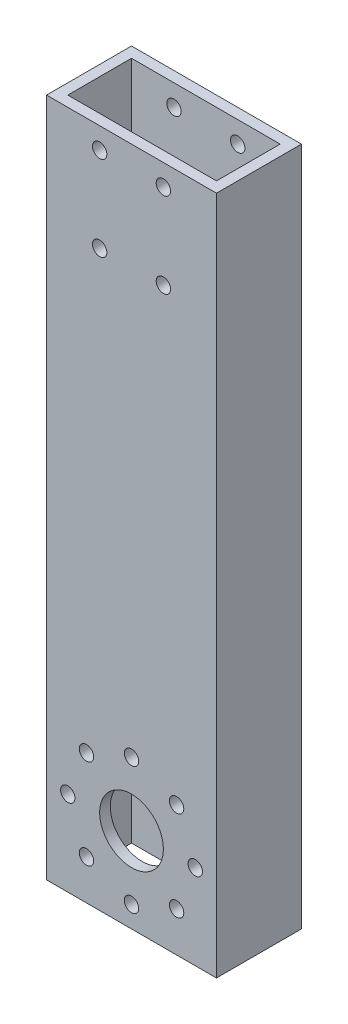
ISO-10303-21;
HEADER;
FILE_DESCRIPTION(('STEP AP214'),'2;1');
FILE_NAME('part.step','',(''),(''),'','','');
FILE_SCHEMA(('AUTOMOTIVE_DESIGN { 1 0 10303 214 1 1 1 1 }'));
ENDSEC;
DATA;
#1=APPLICATION_CONTEXT('core data for automotive mechanical design processes');
#2=APPLICATION_PROTOCOL_DEFINITION('international standard','automotive_design',2000,#1);
#3=PRODUCT_CONTEXT('',#1,'mechanical');
#4=PRODUCT('Part','Part','',(#3));
#5=PRODUCT_RELATED_PRODUCT_CATEGORY('part','',(#4));
#6=PRODUCT_DEFINITION_FORMATION('','',#4);
#7=PRODUCT_DEFINITION_CONTEXT('part definition',#1,'design');
#8=PRODUCT_DEFINITION('design','',#6,#7);
#9=PRODUCT_DEFINITION_SHAPE('','',#8);
#10=(LENGTH_UNIT() NAMED_UNIT(*) SI_UNIT(.MILLI.,.METRE.));
#11=(NAMED_UNIT(*) PLANE_ANGLE_UNIT() SI_UNIT($,.RADIAN.));
#12=(NAMED_UNIT(*) SI_UNIT($,.STERADIAN.) SOLID_ANGLE_UNIT());
#13=UNCERTAINTY_MEASURE_WITH_UNIT(LENGTH_MEASURE(1.E-05),#10,'distance_accuracy_value','');
#14=(GEOMETRIC_REPRESENTATION_CONTEXT(3) GLOBAL_UNCERTAINTY_ASSIGNED_CONTEXT((#13)) GLOBAL_UNIT_ASSIGNED_CONTEXT((#10,
#11,#12)) REPRESENTATION_CONTEXT('',''));
#15=CARTESIAN_POINT('',(0.,0.,0.));
#16=DIRECTION('',(0.,0.,1.));
#17=DIRECTION('',(1.,0.,0.));
#18=AXIS2_PLACEMENT_3D('',#15,#16,#17);
#19=CARTESIAN_POINT('',(-15.1862433862434,457.2,12.0280423280423));
#20=DIRECTION('',(1.,0.,0.));
#21=DIRECTION('',(0.,0.,-1.));
#22=AXIS2_PLACEMENT_3D('',#19,#20,#21);
#23=PLANE('',#22);
#24=DIRECTION('',(0.,-1.,0.));
#25=VECTOR('',#24,1.);
#26=CARTESIAN_POINT('',(-15.1862433862434,457.2,12.0280423280423));
#27=LINE('',#26,#25);
#28=CARTESIAN_POINT('',(-15.1862433862434,177.8,12.0280423280423));
#29=VERTEX_POINT('',#28);
#30=CARTESIAN_POINT('',(-15.1862433862434,-25.4,12.0280423280423));
#31=VERTEX_POINT('',#30);
#32=EDGE_CURVE('E79',#29,#31,#27,.T.);
#33=ORIENTED_EDGE('',*,*,#32,.F.);
#34=DIRECTION('',(0.,0.,1.));
#35=VECTOR('',#34,1.);
#36=CARTESIAN_POINT('',(-15.1862433862434,177.8,-13.3719576719577));
#37=LINE('',#36,#35);
#38=CARTESIAN_POINT('',(-15.1862433862434,177.8,-13.3719576719577));
#39=VERTEX_POINT('',#38);
#40=EDGE_CURVE('E136',#39,#29,#37,.T.);
#41=ORIENTED_EDGE('',*,*,#40,.F.);
#42=DIRECTION('',(0.,-1.,0.));
#43=VECTOR('',#42,1.);
#44=CARTESIAN_POINT('',(-15.1862433862434,457.2,-13.3719576719577));
#45=LINE('',#44,#43);
#46=CARTESIAN_POINT('',(-15.1862433862434,-25.4,-13.3719576719577));
#47=VERTEX_POINT('',#46);
#48=EDGE_CURVE('E146',#39,#47,#45,.T.);
#49=ORIENTED_EDGE('',*,*,#48,.T.);
#50=DIRECTION('',(0.,0.,-1.));
#51=VECTOR('',#50,1.);
#52=CARTESIAN_POINT('',(-15.1862433862434,-25.4,12.0280423280423));
#53=LINE('',#52,#51);
#54=EDGE_CURVE('E555',#31,#47,#53,.T.);
#55=ORIENTED_EDGE('',*,*,#54,.F.);
#56=EDGE_LOOP('',(#33,#41,#49,#55));
#57=FACE_BOUND('',#56,.T.);
#58=ADVANCED_FACE('F69',(#57),#23,.F.);
#59=CARTESIAN_POINT('',(-15.1862433862434,457.2,12.0280423280423));
#60=DIRECTION('',(0.,0.,-1.));
#61=DIRECTION('',(-1.,0.,0.));
#62=AXIS2_PLACEMENT_3D('',#59,#60,#61);
#63=PLANE('',#62);
#64=CARTESIAN_POINT('',(0.68875661375661,146.05,12.0280423280423));
#65=DIRECTION('',(0.,0.,-1.));
#66=DIRECTION('',(-1.,0.,0.));
#67=AXIS2_PLACEMENT_3D('',#64,#65,#66);
#68=CIRCLE('',#67,2.15265);
#69=CARTESIAN_POINT('',(-1.46389338624339,146.05,12.0280423280423));
#70=VERTEX_POINT('',#69);
#71=EDGE_CURVE('E914',#70,#70,#68,.T.);
#72=ORIENTED_EDGE('',*,*,#71,.T.);
#73=EDGE_LOOP('',(#72));
#74=FACE_BOUND('',#73,.T.);
#75=CARTESIAN_POINT('',(19.7387566137566,171.45,12.0280423280423));
#76=DIRECTION('',(0.,0.,-1.));
#77=DIRECTION('',(-1.,0.,0.));
#78=AXIS2_PLACEMENT_3D('',#75,#76,#77);
#79=CIRCLE('',#78,2.15265);
#80=CARTESIAN_POINT('',(17.5861066137566,171.45,12.0280423280423));
#81=VERTEX_POINT('',#80);
#82=EDGE_CURVE('E916',#81,#81,#79,.T.);
#83=ORIENTED_EDGE('',*,*,#82,.T.);
#84=EDGE_LOOP('',(#83));
#85=FACE_BOUND('',#84,.T.);
#86=CARTESIAN_POINT('',(0.68875661375661,171.45,12.0280423280423));
#87=DIRECTION('',(0.,0.,-1.));
#88=DIRECTION('',(-1.,0.,0.));
#89=AXIS2_PLACEMENT_3D('',#86,#87,#88);
#90=CIRCLE('',#89,2.15265);
#91=CARTESIAN_POINT('',(-1.46389338624339,171.45,12.0280423280423));
#92=VERTEX_POINT('',#91);
#93=EDGE_CURVE('E922',#92,#92,#90,.T.);
#94=ORIENTED_EDGE('',*,*,#93,.T.);
#95=EDGE_LOOP('',(#94));
#96=FACE_BOUND('',#95,.T.);
#97=CARTESIAN_POINT('',(19.7387566137566,146.05,12.0280423280423));
#98=DIRECTION('',(0.,0.,-1.));
#99=DIRECTION('',(-1.,0.,0.));
#100=AXIS2_PLACEMENT_3D('',#97,#98,#99);
#101=CIRCLE('',#100,2.15265);
#102=CARTESIAN_POINT('',(17.5861066137566,146.05,12.0280423280423));
#103=VERTEX_POINT('',#102);
#104=EDGE_CURVE('E289',#103,#103,#101,.T.);
#105=ORIENTED_EDGE('',*,*,#104,.T.);
#106=EDGE_LOOP('',(#105));
#107=FACE_BOUND('',#106,.T.);
#108=CARTESIAN_POINT('',(29.2637566137566,0.,12.0280423280423));
#109=DIRECTION('',(0.,0.,1.));
#110=DIRECTION('',(1.,0.,0.));
#111=AXIS2_PLACEMENT_3D('',#108,#109,#110);
#112=CIRCLE('',#111,2.15265);
#113=CARTESIAN_POINT('',(31.4164066137566,0.,12.0280423280423));
#114=VERTEX_POINT('',#113);
#115=EDGE_CURVE('E267',#114,#114,#112,.T.);
#116=ORIENTED_EDGE('',*,*,#115,.F.);
#117=EDGE_LOOP('',(#116));
#118=FACE_BOUND('',#117,.T.);
#119=CARTESIAN_POINT('',(23.6841407953603,13.4703841816038,12.0280423280423));
#120=DIRECTION('',(0.,0.,1.));
#121=DIRECTION('',(1.,0.,0.));
#122=AXIS2_PLACEMENT_3D('',#119,#120,#121);
#123=CIRCLE('',#122,2.15265);
#124=CARTESIAN_POINT('',(25.8367907953603,13.4703841816038,12.0280423280423));
#125=VERTEX_POINT('',#124);
#126=EDGE_CURVE('E393',#125,#125,#123,.T.);
#127=ORIENTED_EDGE('',*,*,#126,.F.);
#128=EDGE_LOOP('',(#127));
#129=FACE_BOUND('',#128,.T.);
#130=CARTESIAN_POINT('',(10.2137566137566,19.05,12.0280423280423));
#131=DIRECTION('',(0.,0.,1.));
#132=DIRECTION('',(1.,0.,0.));
#133=AXIS2_PLACEMENT_3D('',#130,#131,#132);
#134=CIRCLE('',#133,2.15265);
#135=CARTESIAN_POINT('',(12.3664066137566,19.05,12.0280423280423));
#136=VERTEX_POINT('',#135);
#137=EDGE_CURVE('E383',#136,#136,#134,.T.);
#138=ORIENTED_EDGE('',*,*,#137,.F.);
#139=EDGE_LOOP('',(#138));
#140=FACE_BOUND('',#139,.T.);
#141=CARTESIAN_POINT('',(-3.25662756784709,13.4703841816038,12.0280423280423));
#142=DIRECTION('',(0.,0.,1.));
#143=DIRECTION('',(1.,0.,0.));
#144=AXIS2_PLACEMENT_3D('',#141,#142,#143);
#145=CIRCLE('',#144,2.15265);
#146=CARTESIAN_POINT('',(-1.10397756784709,13.4703841816038,12.0280423280423));
#147=VERTEX_POINT('',#146);
#148=EDGE_CURVE('E394',#147,#147,#145,.T.);
#149=ORIENTED_EDGE('',*,*,#148,.F.);
#150=EDGE_LOOP('',(#149));
#151=FACE_BOUND('',#150,.T.);
#152=CARTESIAN_POINT('',(-8.83624338624339,0.,12.0280423280423));
#153=DIRECTION('',(0.,0.,1.));
#154=DIRECTION('',(1.,0.,0.));
#155=AXIS2_PLACEMENT_3D('',#152,#153,#154);
#156=CIRCLE('',#155,2.15265);
#157=CARTESIAN_POINT('',(-6.68359338624339,0.,12.0280423280423));
#158=VERTEX_POINT('',#157);
#159=EDGE_CURVE('E353',#158,#158,#156,.T.);
#160=ORIENTED_EDGE('',*,*,#159,.F.);
#161=EDGE_LOOP('',(#160));
#162=FACE_BOUND('',#161,.T.);
#163=CARTESIAN_POINT('',(-3.25662756784704,-13.4703841816038,12.0280423280423));
#164=DIRECTION('',(0.,0.,1.));
#165=DIRECTION('',(1.,0.,0.));
#166=AXIS2_PLACEMENT_3D('',#163,#164,#165);
#167=CIRCLE('',#166,2.15264999999999);
#168=CARTESIAN_POINT('',(-1.10397756784705,-13.4703841816038,12.0280423280423));
#169=VERTEX_POINT('',#168);
#170=EDGE_CURVE('E649',#169,#169,#167,.T.);
#171=ORIENTED_EDGE('',*,*,#170,.F.);
#172=EDGE_LOOP('',(#171));
#173=FACE_BOUND('',#172,.T.);
#174=CARTESIAN_POINT('',(10.2137566137566,-19.05,12.0280423280423));
#175=DIRECTION('',(0.,0.,1.));
#176=DIRECTION('',(1.,0.,0.));
#177=AXIS2_PLACEMENT_3D('',#174,#175,#176);
#178=CIRCLE('',#177,2.15265);
#179=CARTESIAN_POINT('',(12.3664066137566,-19.05,12.0280423280423));
#180=VERTEX_POINT('',#179);
#181=EDGE_CURVE('E266',#180,#180,#178,.T.);
#182=ORIENTED_EDGE('',*,*,#181,.F.);
#183=EDGE_LOOP('',(#182));
#184=FACE_BOUND('',#183,.T.);
#185=CARTESIAN_POINT('',(23.6841407953603,-13.4703841816037,12.0280423280423));
#186=DIRECTION('',(0.,0.,1.));
#187=DIRECTION('',(1.,0.,0.));
#188=AXIS2_PLACEMENT_3D('',#185,#186,#187);
#189=CIRCLE('',#188,2.15265);
#190=CARTESIAN_POINT('',(25.8367907953603,-13.4703841816037,12.0280423280423));
#191=VERTEX_POINT('',#190);
#192=EDGE_CURVE('E254',#191,#191,#189,.T.);
#193=ORIENTED_EDGE('',*,*,#192,.F.);
#194=EDGE_LOOP('',(#193));
#195=FACE_BOUND('',#194,.T.);
#196=CARTESIAN_POINT('',(10.2137566137566,0.,12.0280423280423));
#197=DIRECTION('',(0.,0.,1.));
#198=DIRECTION('',(1.,0.,0.));
#199=AXIS2_PLACEMENT_3D('',#196,#197,#198);
#200=CIRCLE('',#199,9.525);
#201=CARTESIAN_POINT('',(19.7387566137566,0.,12.0280423280423));
#202=VERTEX_POINT('',#201);
#203=EDGE_CURVE('E401',#202,#202,#200,.T.);
#204=ORIENTED_EDGE('',*,*,#203,.F.);
#205=EDGE_LOOP('',(#204));
#206=FACE_BOUND('',#205,.T.);
#207=DIRECTION('',(0.,-1.,0.));
#208=VECTOR('',#207,1.);
#209=CARTESIAN_POINT('',(35.6137566137566,457.2,12.0280423280423));
#210=LINE('',#209,#208);
#211=CARTESIAN_POINT('',(35.6137566137566,177.8,12.0280423280423));
#212=VERTEX_POINT('',#211);
#213=CARTESIAN_POINT('',(35.6137566137566,-25.4,12.0280423280423));
#214=VERTEX_POINT('',#213);
#215=EDGE_CURVE('E161',#212,#214,#210,.T.);
#216=ORIENTED_EDGE('',*,*,#215,.F.);
#217=DIRECTION('',(1.,0.,0.));
#218=VECTOR('',#217,1.);
#219=CARTESIAN_POINT('',(35.6137566137566,177.8,12.0280423280423));
#220=LINE('',#219,#218);
#221=EDGE_CURVE('E149',#29,#212,#220,.T.);
#222=ORIENTED_EDGE('',*,*,#221,.F.);
#223=ORIENTED_EDGE('',*,*,#32,.T.);
#224=DIRECTION('',(-1.,0.,0.));
#225=VECTOR('',#224,1.);
#226=CARTESIAN_POINT('',(35.6137566137566,-25.4,12.0280423280423));
#227=LINE('',#226,#225);
#228=EDGE_CURVE('E551',#214,#31,#227,.T.);
#229=ORIENTED_EDGE('',*,*,#228,.F.);
#230=EDGE_LOOP('',(#216,#222,#223,#229));
#231=FACE_BOUND('',#230,.T.);
#232=ADVANCED_FACE('F463',(#74,#85,#96,#107,#118,#129,#140,#151,#162,#173,#184,#195,#206,#231),
#63,.F.);
#233=CARTESIAN_POINT('',(35.6137566137566,457.2,12.0280423280423));
#234=DIRECTION('',(-1.,0.,0.));
#235=DIRECTION('',(0.,0.,1.));
#236=AXIS2_PLACEMENT_3D('',#233,#234,#235);
#237=PLANE('',#236);
#238=DIRECTION('',(0.,-1.,0.));
#239=VECTOR('',#238,1.);
#240=CARTESIAN_POINT('',(35.6137566137566,457.2,-13.3719576719577));
#241=LINE('',#240,#239);
#242=CARTESIAN_POINT('',(35.6137566137566,177.8,-13.3719576719577));
#243=VERTEX_POINT('',#242);
#244=CARTESIAN_POINT('',(35.6137566137566,-25.4,-13.3719576719577));
#245=VERTEX_POINT('',#244);
#246=EDGE_CURVE('E156',#243,#245,#241,.T.);
#247=ORIENTED_EDGE('',*,*,#246,.F.);
#248=DIRECTION('',(0.,0.,-1.));
#249=VECTOR('',#248,1.);
#250=CARTESIAN_POINT('',(35.6137566137566,177.8,-13.3719576719577));
#251=LINE('',#250,#249);
#252=EDGE_CURVE('E87',#212,#243,#251,.T.);
#253=ORIENTED_EDGE('',*,*,#252,.F.);
#254=ORIENTED_EDGE('',*,*,#215,.T.);
#255=DIRECTION('',(0.,0.,1.));
#256=VECTOR('',#255,1.);
#257=CARTESIAN_POINT('',(35.6137566137566,-25.4,-13.3719576719577));
#258=LINE('',#257,#256);
#259=EDGE_CURVE('E560',#245,#214,#258,.T.);
#260=ORIENTED_EDGE('',*,*,#259,.F.);
#261=EDGE_LOOP('',(#247,#253,#254,#260));
#262=FACE_BOUND('',#261,.T.);
#263=ADVANCED_FACE('F418',(#262),#237,.F.);
#264=CARTESIAN_POINT('',(-15.1862433862434,457.2,-13.3719576719577));
#265=DIRECTION('',(0.,0.,1.));
#266=DIRECTION('',(1.,0.,0.));
#267=AXIS2_PLACEMENT_3D('',#264,#265,#266);
#268=PLANE('',#267);
#269=CARTESIAN_POINT('',(0.68875661375661,146.05,-13.3719576719577));
#270=DIRECTION('',(0.,0.,1.));
#271=DIRECTION('',(1.,0.,0.));
#272=AXIS2_PLACEMENT_3D('',#269,#270,#271);
#273=CIRCLE('',#272,2.15265);
#274=CARTESIAN_POINT('',(2.84140661375661,146.05,-13.3719576719577));
#275=VERTEX_POINT('',#274);
#276=EDGE_CURVE('E334',#275,#275,#273,.T.);
#277=ORIENTED_EDGE('',*,*,#276,.T.);
#278=EDGE_LOOP('',(#277));
#279=FACE_BOUND('',#278,.T.);
#280=CARTESIAN_POINT('',(19.7387566137566,171.45,-13.3719576719577));
#281=DIRECTION('',(0.,0.,1.));
#282=DIRECTION('',(1.,0.,0.));
#283=AXIS2_PLACEMENT_3D('',#280,#281,#282);
#284=CIRCLE('',#283,2.15265);
#285=CARTESIAN_POINT('',(21.8914066137566,171.45,-13.3719576719577));
#286=VERTEX_POINT('',#285);
#287=EDGE_CURVE('E320',#286,#286,#284,.T.);
#288=ORIENTED_EDGE('',*,*,#287,.T.);
#289=EDGE_LOOP('',(#288));
#290=FACE_BOUND('',#289,.T.);
#291=CARTESIAN_POINT('',(0.68875661375661,171.45,-13.3719576719577));
#292=DIRECTION('',(0.,0.,1.));
#293=DIRECTION('',(1.,0.,0.));
#294=AXIS2_PLACEMENT_3D('',#291,#292,#293);
#295=CIRCLE('',#294,2.15265);
#296=CARTESIAN_POINT('',(2.84140661375661,171.45,-13.3719576719577));
#297=VERTEX_POINT('',#296);
#298=EDGE_CURVE('E302',#297,#297,#295,.T.);
#299=ORIENTED_EDGE('',*,*,#298,.T.);
#300=EDGE_LOOP('',(#299));
#301=FACE_BOUND('',#300,.T.);
#302=CARTESIAN_POINT('',(19.7387566137566,146.05,-13.3719576719577));
#303=DIRECTION('',(0.,0.,1.));
#304=DIRECTION('',(1.,0.,0.));
#305=AXIS2_PLACEMENT_3D('',#302,#303,#304);
#306=CIRCLE('',#305,2.15265);
#307=CARTESIAN_POINT('',(21.8914066137566,146.05,-13.3719576719577));
#308=VERTEX_POINT('',#307);
#309=EDGE_CURVE('E295',#308,#308,#306,.T.);
#310=ORIENTED_EDGE('',*,*,#309,.T.);
#311=EDGE_LOOP('',(#310));
#312=FACE_BOUND('',#311,.T.);
#313=CARTESIAN_POINT('',(29.2637566137566,0.,-13.3719576719577));
#314=DIRECTION('',(0.,0.,1.));
#315=DIRECTION('',(1.,0.,0.));
#316=AXIS2_PLACEMENT_3D('',#313,#314,#315);
#317=CIRCLE('',#316,2.15265);
#318=CARTESIAN_POINT('',(31.4164066137566,0.,-13.3719576719577));
#319=VERTEX_POINT('',#318);
#320=EDGE_CURVE('E272',#319,#319,#317,.F.);
#321=ORIENTED_EDGE('',*,*,#320,.F.);
#322=EDGE_LOOP('',(#321));
#323=FACE_BOUND('',#322,.T.);
#324=CARTESIAN_POINT('',(23.6841407953603,13.4703841816038,-13.3719576719577));
#325=DIRECTION('',(0.,0.,1.));
#326=DIRECTION('',(1.,0.,0.));
#327=AXIS2_PLACEMENT_3D('',#324,#325,#326);
#328=CIRCLE('',#327,2.15265);
#329=CARTESIAN_POINT('',(25.8367907953603,13.4703841816038,-13.3719576719577));
#330=VERTEX_POINT('',#329);
#331=EDGE_CURVE('E273',#330,#330,#328,.F.);
#332=ORIENTED_EDGE('',*,*,#331,.F.);
#333=EDGE_LOOP('',(#332));
#334=FACE_BOUND('',#333,.T.);
#335=CARTESIAN_POINT('',(10.2137566137566,19.05,-13.3719576719577));
#336=DIRECTION('',(0.,0.,1.));
#337=DIRECTION('',(1.,0.,0.));
#338=AXIS2_PLACEMENT_3D('',#335,#336,#337);
#339=CIRCLE('',#338,2.15265);
#340=CARTESIAN_POINT('',(12.3664066137566,19.05,-13.3719576719577));
#341=VERTEX_POINT('',#340);
#342=EDGE_CURVE('E389',#341,#341,#339,.F.);
#343=ORIENTED_EDGE('',*,*,#342,.F.);
#344=EDGE_LOOP('',(#343));
#345=FACE_BOUND('',#344,.T.);
#346=CARTESIAN_POINT('',(-3.25662756784709,13.4703841816038,-13.3719576719577));
#347=DIRECTION('',(0.,0.,1.));
#348=DIRECTION('',(1.,0.,0.));
#349=AXIS2_PLACEMENT_3D('',#346,#347,#348);
#350=CIRCLE('',#349,2.15265);
#351=CARTESIAN_POINT('',(-1.10397756784709,13.4703841816038,-13.3719576719577));
#352=VERTEX_POINT('',#351);
#353=EDGE_CURVE('E390',#352,#352,#350,.F.);
#354=ORIENTED_EDGE('',*,*,#353,.F.);
#355=EDGE_LOOP('',(#354));
#356=FACE_BOUND('',#355,.T.);
#357=CARTESIAN_POINT('',(-8.83624338624339,0.,-13.3719576719577));
#358=DIRECTION('',(0.,0.,1.));
#359=DIRECTION('',(1.,0.,0.));
#360=AXIS2_PLACEMENT_3D('',#357,#358,#359);
#361=CIRCLE('',#360,2.15265);
#362=CARTESIAN_POINT('',(-6.68359338624339,0.,-13.3719576719577));
#363=VERTEX_POINT('',#362);
#364=EDGE_CURVE('E358',#363,#363,#361,.F.);
#365=ORIENTED_EDGE('',*,*,#364,.F.);
#366=EDGE_LOOP('',(#365));
#367=FACE_BOUND('',#366,.T.);
#368=CARTESIAN_POINT('',(-3.25662756784704,-13.4703841816038,-13.3719576719577));
#369=DIRECTION('',(0.,0.,1.));
#370=DIRECTION('',(1.,0.,0.));
#371=AXIS2_PLACEMENT_3D('',#368,#369,#370);
#372=CIRCLE('',#371,2.15264999999999);
#373=CARTESIAN_POINT('',(-1.10397756784705,-13.4703841816038,-13.3719576719577));
#374=VERTEX_POINT('',#373);
#375=EDGE_CURVE('E359',#374,#374,#372,.F.);
#376=ORIENTED_EDGE('',*,*,#375,.F.);
#377=EDGE_LOOP('',(#376));
#378=FACE_BOUND('',#377,.T.);
#379=CARTESIAN_POINT('',(10.2137566137566,-19.05,-13.3719576719577));
#380=DIRECTION('',(0.,0.,1.));
#381=DIRECTION('',(1.,0.,0.));
#382=AXIS2_PLACEMENT_3D('',#379,#380,#381);
#383=CIRCLE('',#382,2.15265);
#384=CARTESIAN_POINT('',(12.3664066137566,-19.05,-13.3719576719577));
#385=VERTEX_POINT('',#384);
#386=EDGE_CURVE('E261',#385,#385,#383,.F.);
#387=ORIENTED_EDGE('',*,*,#386,.F.);
#388=EDGE_LOOP('',(#387));
#389=FACE_BOUND('',#388,.T.);
#390=CARTESIAN_POINT('',(23.6841407953603,-13.4703841816037,-13.3719576719577));
#391=DIRECTION('',(0.,0.,1.));
#392=DIRECTION('',(1.,0.,0.));
#393=AXIS2_PLACEMENT_3D('',#390,#391,#392);
#394=CIRCLE('',#393,2.15265);
#395=CARTESIAN_POINT('',(25.8367907953603,-13.4703841816037,-13.3719576719577));
#396=VERTEX_POINT('',#395);
#397=EDGE_CURVE('E260',#396,#396,#394,.F.);
#398=ORIENTED_EDGE('',*,*,#397,.F.);
#399=EDGE_LOOP('',(#398));
#400=FACE_BOUND('',#399,.T.);
#401=CARTESIAN_POINT('',(10.2137566137566,0.,-13.3719576719577));
#402=DIRECTION('',(0.,0.,1.));
#403=DIRECTION('',(1.,0.,0.));
#404=AXIS2_PLACEMENT_3D('',#401,#402,#403);
#405=CIRCLE('',#404,9.525);
#406=CARTESIAN_POINT('',(19.7387566137566,0.,-13.3719576719577));
#407=VERTEX_POINT('',#406);
#408=EDGE_CURVE('E177',#407,#407,#405,.F.);
#409=ORIENTED_EDGE('',*,*,#408,.F.);
#410=EDGE_LOOP('',(#409));
#411=FACE_BOUND('',#410,.T.);
#412=ORIENTED_EDGE('',*,*,#48,.F.);
#413=DIRECTION('',(-1.,0.,0.));
#414=VECTOR('',#413,1.);
#415=CARTESIAN_POINT('',(35.6137566137566,177.8,-13.3719576719577));
#416=LINE('',#415,#414);
#417=EDGE_CURVE('E133',#243,#39,#416,.T.);
#418=ORIENTED_EDGE('',*,*,#417,.F.);
#419=ORIENTED_EDGE('',*,*,#246,.T.);
#420=DIRECTION('',(1.,0.,0.));
#421=VECTOR('',#420,1.);
#422=CARTESIAN_POINT('',(-15.1862433862434,-25.4,-13.3719576719577));
#423=LINE('',#422,#421);
#424=EDGE_CURVE('E154',#47,#245,#423,.T.);
#425=ORIENTED_EDGE('',*,*,#424,.F.);
#426=EDGE_LOOP('',(#412,#418,#419,#425));
#427=FACE_BOUND('',#426,.T.);
#428=ADVANCED_FACE('F152',(#279,#290,#301,#312,#323,#334,#345,#356,#367,#378,#389,#400,#411,
#427),#268,.F.);
#429=CARTESIAN_POINT('',(-12.0112433862434,457.2,0.));
#430=DIRECTION('',(1.,0.,0.));
#431=DIRECTION('',(0.,0.,-1.));
#432=AXIS2_PLACEMENT_3D('',#429,#430,#431);
#433=PLANE('',#432);
#434=DIRECTION('',(0.,0.,-1.));
#435=VECTOR('',#434,1.);
#436=CARTESIAN_POINT('',(-12.0112433862434,177.8,0.));
#437=LINE('',#436,#435);
#438=CARTESIAN_POINT('',(-12.0112433862434,177.8,8.85304232804233));
#439=VERTEX_POINT('',#438);
#440=CARTESIAN_POINT('',(-12.0112433862434,177.8,-10.1969576719577));
#441=VERTEX_POINT('',#440);
#442=EDGE_CURVE('E94',#439,#441,#437,.T.);
#443=ORIENTED_EDGE('',*,*,#442,.F.);
#444=DIRECTION('',(0.,-1.,0.));
#445=VECTOR('',#444,1.);
#446=CARTESIAN_POINT('',(-12.0112433862434,457.2,8.85304232804233));
#447=LINE('',#446,#445);
#448=CARTESIAN_POINT('',(-12.0112433862434,-25.4,8.85304232804233));
#449=VERTEX_POINT('',#448);
#450=EDGE_CURVE('E157',#439,#449,#447,.T.);
#451=ORIENTED_EDGE('',*,*,#450,.T.);
#452=DIRECTION('',(0.,0.,-1.));
#453=VECTOR('',#452,1.);
#454=CARTESIAN_POINT('',(-12.0112433862434,-25.4,-10.1969576719577));
#455=LINE('',#454,#453);
#456=CARTESIAN_POINT('',(-12.0112433862434,-25.4,-10.1969576719577));
#457=VERTEX_POINT('',#456);
#458=EDGE_CURVE('E547',#449,#457,#455,.T.);
#459=ORIENTED_EDGE('',*,*,#458,.T.);
#460=DIRECTION('',(0.,-1.,0.));
#461=VECTOR('',#460,1.);
#462=CARTESIAN_POINT('',(-12.0112433862434,457.2,-10.1969576719577));
#463=LINE('',#462,#461);
#464=EDGE_CURVE('E564',#441,#457,#463,.T.);
#465=ORIENTED_EDGE('',*,*,#464,.F.);
#466=EDGE_LOOP('',(#443,#451,#459,#465));
#467=FACE_BOUND('',#466,.T.);
#468=ADVANCED_FACE('F417',(#467),#433,.T.);
#469=CARTESIAN_POINT('',(0.,457.2,8.85304232804233));
#470=DIRECTION('',(0.,0.,-1.));
#471=DIRECTION('',(-1.,0.,0.));
#472=AXIS2_PLACEMENT_3D('',#469,#470,#471);
#473=PLANE('',#472);
#474=CARTESIAN_POINT('',(0.68875661375661,146.05,8.85304232804233));
#475=DIRECTION('',(0.,0.,-1.));
#476=DIRECTION('',(-1.,0.,0.));
#477=AXIS2_PLACEMENT_3D('',#474,#475,#476);
#478=CIRCLE('',#477,2.15265);
#479=CARTESIAN_POINT('',(-1.46389338624339,146.05,8.85304232804233));
#480=VERTEX_POINT('',#479);
#481=EDGE_CURVE('E325',#480,#480,#478,.T.);
#482=ORIENTED_EDGE('',*,*,#481,.F.);
#483=EDGE_LOOP('',(#482));
#484=FACE_BOUND('',#483,.T.);
#485=CARTESIAN_POINT('',(19.7387566137566,171.45,8.85304232804233));
#486=DIRECTION('',(0.,0.,-1.));
#487=DIRECTION('',(-1.,0.,0.));
#488=AXIS2_PLACEMENT_3D('',#485,#486,#487);
#489=CIRCLE('',#488,2.15265);
#490=CARTESIAN_POINT('',(17.5861066137566,171.45,8.85304232804233));
#491=VERTEX_POINT('',#490);
#492=EDGE_CURVE('E309',#491,#491,#489,.T.);
#493=ORIENTED_EDGE('',*,*,#492,.F.);
#494=EDGE_LOOP('',(#493));
#495=FACE_BOUND('',#494,.T.);
#496=CARTESIAN_POINT('',(0.68875661375661,171.45,8.85304232804233));
#497=DIRECTION('',(0.,0.,-1.));
#498=DIRECTION('',(-1.,0.,0.));
#499=AXIS2_PLACEMENT_3D('',#496,#497,#498);
#500=CIRCLE('',#499,2.15265);
#501=CARTESIAN_POINT('',(-1.46389338624339,171.45,8.85304232804233));
#502=VERTEX_POINT('',#501);
#503=EDGE_CURVE('E294',#502,#502,#500,.T.);
#504=ORIENTED_EDGE('',*,*,#503,.F.);
#505=EDGE_LOOP('',(#504));
#506=FACE_BOUND('',#505,.T.);
#507=CARTESIAN_POINT('',(19.7387566137566,146.05,8.85304232804233));
#508=DIRECTION('',(0.,0.,-1.));
#509=DIRECTION('',(-1.,0.,0.));
#510=AXIS2_PLACEMENT_3D('',#507,#508,#509);
#511=CIRCLE('',#510,2.15265);
#512=CARTESIAN_POINT('',(17.5861066137566,146.05,8.85304232804233));
#513=VERTEX_POINT('',#512);
#514=EDGE_CURVE('E288',#513,#513,#511,.T.);
#515=ORIENTED_EDGE('',*,*,#514,.F.);
#516=EDGE_LOOP('',(#515));
#517=FACE_BOUND('',#516,.T.);
#518=DIRECTION('',(-1.,0.,0.));
#519=VECTOR('',#518,1.);
#520=CARTESIAN_POINT('',(0.,177.8,8.85304232804233));
#521=LINE('',#520,#519);
#522=CARTESIAN_POINT('',(32.4387566137566,177.8,8.85304232804233));
#523=VERTEX_POINT('',#522);
#524=EDGE_CURVE('E348',#523,#439,#521,.T.);
#525=ORIENTED_EDGE('',*,*,#524,.F.);
#526=DIRECTION('',(0.,-1.,0.));
#527=VECTOR('',#526,1.);
#528=CARTESIAN_POINT('',(32.4387566137566,457.2,8.85304232804233));
#529=LINE('',#528,#527);
#530=CARTESIAN_POINT('',(32.4387566137566,-25.4,8.85304232804233));
#531=VERTEX_POINT('',#530);
#532=EDGE_CURVE('E163',#523,#531,#529,.T.);
#533=ORIENTED_EDGE('',*,*,#532,.T.);
#534=DIRECTION('',(-1.,0.,0.));
#535=VECTOR('',#534,1.);
#536=CARTESIAN_POINT('',(-12.0112433862434,-25.4,8.85304232804233));
#537=LINE('',#536,#535);
#538=EDGE_CURVE('E543',#531,#449,#537,.T.);
#539=ORIENTED_EDGE('',*,*,#538,.T.);
#540=ORIENTED_EDGE('',*,*,#450,.F.);
#541=EDGE_LOOP('',(#525,#533,#539,#540));
#542=FACE_BOUND('',#541,.T.);
#543=CARTESIAN_POINT('',(29.2637566137566,0.,8.85304232804233));
#544=DIRECTION('',(0.,0.,-1.));
#545=DIRECTION('',(-1.,0.,0.));
#546=AXIS2_PLACEMENT_3D('',#543,#544,#545);
#547=CIRCLE('',#546,2.15265);
#548=CARTESIAN_POINT('',(27.1111066137566,0.,8.85304232804233));
#549=VERTEX_POINT('',#548);
#550=EDGE_CURVE('E232',#549,#549,#547,.T.);
#551=ORIENTED_EDGE('',*,*,#550,.F.);
#552=EDGE_LOOP('',(#551));
#553=FACE_BOUND('',#552,.T.);
#554=CARTESIAN_POINT('',(23.6841407953603,13.4703841816038,8.85304232804233));
#555=DIRECTION('',(0.,0.,-1.));
#556=DIRECTION('',(-1.,0.,0.));
#557=AXIS2_PLACEMENT_3D('',#554,#555,#556);
#558=CIRCLE('',#557,2.15265);
#559=CARTESIAN_POINT('',(21.5314907953603,13.4703841816038,8.85304232804233));
#560=VERTEX_POINT('',#559);
#561=EDGE_CURVE('E227',#560,#560,#558,.T.);
#562=ORIENTED_EDGE('',*,*,#561,.F.);
#563=EDGE_LOOP('',(#562));
#564=FACE_BOUND('',#563,.T.);
#565=CARTESIAN_POINT('',(10.2137566137566,19.05,8.85304232804233));
#566=DIRECTION('',(0.,0.,-1.));
#567=DIRECTION('',(-1.,0.,0.));
#568=AXIS2_PLACEMENT_3D('',#565,#566,#567);
#569=CIRCLE('',#568,2.15265);
#570=CARTESIAN_POINT('',(8.06110661375661,19.05,8.85304232804233));
#571=VERTEX_POINT('',#570);
#572=EDGE_CURVE('E220',#571,#571,#569,.T.);
#573=ORIENTED_EDGE('',*,*,#572,.F.);
#574=EDGE_LOOP('',(#573));
#575=FACE_BOUND('',#574,.T.);
#576=CARTESIAN_POINT('',(-3.25662756784709,13.4703841816038,8.85304232804233));
#577=DIRECTION('',(0.,0.,-1.));
#578=DIRECTION('',(-1.,0.,0.));
#579=AXIS2_PLACEMENT_3D('',#576,#577,#578);
#580=CIRCLE('',#579,2.15265);
#581=CARTESIAN_POINT('',(-5.40927756784709,13.4703841816038,8.85304232804233));
#582=VERTEX_POINT('',#581);
#583=EDGE_CURVE('E221',#582,#582,#580,.T.);
#584=ORIENTED_EDGE('',*,*,#583,.F.);
#585=EDGE_LOOP('',(#584));
#586=FACE_BOUND('',#585,.T.);
#587=CARTESIAN_POINT('',(-8.83624338624339,0.,8.85304232804233));
#588=DIRECTION('',(0.,0.,-1.));
#589=DIRECTION('',(-1.,0.,0.));
#590=AXIS2_PLACEMENT_3D('',#587,#588,#589);
#591=CIRCLE('',#590,2.15265);
#592=CARTESIAN_POINT('',(-10.9888933862434,0.,8.85304232804233));
#593=VERTEX_POINT('',#592);
#594=EDGE_CURVE('E207',#593,#593,#591,.T.);
#595=ORIENTED_EDGE('',*,*,#594,.F.);
#596=EDGE_LOOP('',(#595));
#597=FACE_BOUND('',#596,.T.);
#598=CARTESIAN_POINT('',(-3.25662756784704,-13.4703841816038,8.85304232804233));
#599=DIRECTION('',(0.,0.,-1.));
#600=DIRECTION('',(-1.,0.,0.));
#601=AXIS2_PLACEMENT_3D('',#598,#599,#600);
#602=CIRCLE('',#601,2.15264999999999);
#603=CARTESIAN_POINT('',(-5.40927756784704,-13.4703841816038,8.85304232804233));
#604=VERTEX_POINT('',#603);
#605=EDGE_CURVE('E201',#604,#604,#602,.T.);
#606=ORIENTED_EDGE('',*,*,#605,.F.);
#607=EDGE_LOOP('',(#606));
#608=FACE_BOUND('',#607,.T.);
#609=CARTESIAN_POINT('',(10.2137566137566,-19.05,8.85304232804233));
#610=DIRECTION('',(0.,0.,-1.));
#611=DIRECTION('',(-1.,0.,0.));
#612=AXIS2_PLACEMENT_3D('',#609,#610,#611);
#613=CIRCLE('',#612,2.15265);
#614=CARTESIAN_POINT('',(8.06110661375661,-19.05,8.85304232804233));
#615=VERTEX_POINT('',#614);
#616=EDGE_CURVE('E194',#615,#615,#613,.T.);
#617=ORIENTED_EDGE('',*,*,#616,.F.);
#618=EDGE_LOOP('',(#617));
#619=FACE_BOUND('',#618,.T.);
#620=CARTESIAN_POINT('',(23.6841407953603,-13.4703841816037,8.85304232804233));
#621=DIRECTION('',(0.,0.,-1.));
#622=DIRECTION('',(-1.,0.,0.));
#623=AXIS2_PLACEMENT_3D('',#620,#621,#622);
#624=CIRCLE('',#623,2.15265);
#625=CARTESIAN_POINT('',(21.5314907953603,-13.4703841816037,8.85304232804233));
#626=VERTEX_POINT('',#625);
#627=EDGE_CURVE('E195',#626,#626,#624,.T.);
#628=ORIENTED_EDGE('',*,*,#627,.F.);
#629=EDGE_LOOP('',(#628));
#630=FACE_BOUND('',#629,.T.);
#631=CARTESIAN_POINT('',(10.2137566137566,0.,8.85304232804233));
#632=DIRECTION('',(0.,0.,-1.));
#633=DIRECTION('',(-1.,0.,0.));
#634=AXIS2_PLACEMENT_3D('',#631,#632,#633);
#635=CIRCLE('',#634,9.525);
#636=CARTESIAN_POINT('',(0.688756613756608,0.,8.85304232804233));
#637=VERTEX_POINT('',#636);
#638=EDGE_CURVE('E176',#637,#637,#635,.T.);
#639=ORIENTED_EDGE('',*,*,#638,.F.);
#640=EDGE_LOOP('',(#639));
#641=FACE_BOUND('',#640,.T.);
#642=ADVANCED_FACE('F478',(#484,#495,#506,#517,#542,#553,#564,#575,#586,#597,#608,#619,#630,
#641),#473,.T.);
#643=CARTESIAN_POINT('',(32.4387566137566,457.2,0.));
#644=DIRECTION('',(-1.,0.,0.));
#645=DIRECTION('',(0.,0.,1.));
#646=AXIS2_PLACEMENT_3D('',#643,#644,#645);
#647=PLANE('',#646);
#648=DIRECTION('',(0.,0.,1.));
#649=VECTOR('',#648,1.);
#650=CARTESIAN_POINT('',(32.4387566137566,177.8,0.));
#651=LINE('',#650,#649);
#652=CARTESIAN_POINT('',(32.4387566137566,177.8,-10.1969576719577));
#653=VERTEX_POINT('',#652);
#654=EDGE_CURVE('E345',#653,#523,#651,.T.);
#655=ORIENTED_EDGE('',*,*,#654,.F.);
#656=DIRECTION('',(0.,-1.,0.));
#657=VECTOR('',#656,1.);
#658=CARTESIAN_POINT('',(32.4387566137566,457.2,-10.1969576719577));
#659=LINE('',#658,#657);
#660=CARTESIAN_POINT('',(32.4387566137566,-25.4,-10.1969576719577));
#661=VERTEX_POINT('',#660);
#662=EDGE_CURVE('E567',#653,#661,#659,.T.);
#663=ORIENTED_EDGE('',*,*,#662,.T.);
#664=DIRECTION('',(0.,0.,1.));
#665=VECTOR('',#664,1.);
#666=CARTESIAN_POINT('',(32.4387566137566,-25.4,8.85304232804233));
#667=LINE('',#666,#665);
#668=EDGE_CURVE('E539',#661,#531,#667,.T.);
#669=ORIENTED_EDGE('',*,*,#668,.T.);
#670=ORIENTED_EDGE('',*,*,#532,.F.);
#671=EDGE_LOOP('',(#655,#663,#669,#670));
#672=FACE_BOUND('',#671,.T.);
#673=ADVANCED_FACE('F482',(#672),#647,.T.);
#674=CARTESIAN_POINT('',(0.,457.2,-10.1969576719577));
#675=DIRECTION('',(0.,0.,1.));
#676=DIRECTION('',(1.,0.,0.));
#677=AXIS2_PLACEMENT_3D('',#674,#675,#676);
#678=PLANE('',#677);
#679=CARTESIAN_POINT('',(0.68875661375661,146.05,-10.1969576719577));
#680=DIRECTION('',(0.,0.,1.));
#681=DIRECTION('',(1.,0.,0.));
#682=AXIS2_PLACEMENT_3D('',#679,#680,#681);
#683=CIRCLE('',#682,2.15265);
#684=CARTESIAN_POINT('',(2.84140661375661,146.05,-10.1969576719577));
#685=VERTEX_POINT('',#684);
#686=EDGE_CURVE('E72',#685,#685,#683,.T.);
#687=ORIENTED_EDGE('',*,*,#686,.F.);
#688=EDGE_LOOP('',(#687));
#689=FACE_BOUND('',#688,.T.);
#690=CARTESIAN_POINT('',(19.7387566137566,171.45,-10.1969576719577));
#691=DIRECTION('',(0.,0.,1.));
#692=DIRECTION('',(1.,0.,0.));
#693=AXIS2_PLACEMENT_3D('',#690,#691,#692);
#694=CIRCLE('',#693,2.15265);
#695=CARTESIAN_POINT('',(21.8914066137566,171.45,-10.1969576719577));
#696=VERTEX_POINT('',#695);
#697=EDGE_CURVE('E296',#696,#696,#694,.T.);
#698=ORIENTED_EDGE('',*,*,#697,.F.);
#699=EDGE_LOOP('',(#698));
#700=FACE_BOUND('',#699,.T.);
#701=CARTESIAN_POINT('',(0.68875661375661,171.45,-10.1969576719577));
#702=DIRECTION('',(0.,0.,1.));
#703=DIRECTION('',(1.,0.,0.));
#704=AXIS2_PLACEMENT_3D('',#701,#702,#703);
#705=CIRCLE('',#704,2.15265);
#706=CARTESIAN_POINT('',(2.84140661375661,171.45,-10.1969576719577));
#707=VERTEX_POINT('',#706);
#708=EDGE_CURVE('E290',#707,#707,#705,.T.);
#709=ORIENTED_EDGE('',*,*,#708,.F.);
#710=EDGE_LOOP('',(#709));
#711=FACE_BOUND('',#710,.T.);
#712=CARTESIAN_POINT('',(19.7387566137566,146.05,-10.1969576719577));
#713=DIRECTION('',(0.,0.,1.));
#714=DIRECTION('',(1.,0.,0.));
#715=AXIS2_PLACEMENT_3D('',#712,#713,#714);
#716=CIRCLE('',#715,2.15265);
#717=CARTESIAN_POINT('',(21.8914066137566,146.05,-10.1969576719577));
#718=VERTEX_POINT('',#717);
#719=EDGE_CURVE('E283',#718,#718,#716,.T.);
#720=ORIENTED_EDGE('',*,*,#719,.F.);
#721=EDGE_LOOP('',(#720));
#722=FACE_BOUND('',#721,.T.);
#723=DIRECTION('',(1.,0.,0.));
#724=VECTOR('',#723,1.);
#725=CARTESIAN_POINT('',(0.,177.8,-10.1969576719577));
#726=LINE('',#725,#724);
#727=EDGE_CURVE('E13',#441,#653,#726,.T.);
#728=ORIENTED_EDGE('',*,*,#727,.F.);
#729=ORIENTED_EDGE('',*,*,#464,.T.);
#730=DIRECTION('',(1.,0.,0.));
#731=VECTOR('',#730,1.);
#732=CARTESIAN_POINT('',(32.4387566137566,-25.4,-10.1969576719577));
#733=LINE('',#732,#731);
#734=EDGE_CURVE('E536',#457,#661,#733,.T.);
#735=ORIENTED_EDGE('',*,*,#734,.T.);
#736=ORIENTED_EDGE('',*,*,#662,.F.);
#737=EDGE_LOOP('',(#728,#729,#735,#736));
#738=FACE_BOUND('',#737,.T.);
#739=CARTESIAN_POINT('',(29.2637566137566,0.,-10.1969576719577));
#740=DIRECTION('',(0.,0.,1.));
#741=DIRECTION('',(1.,0.,0.));
#742=AXIS2_PLACEMENT_3D('',#739,#740,#741);
#743=CIRCLE('',#742,2.15265);
#744=CARTESIAN_POINT('',(31.4164066137566,0.,-10.1969576719577));
#745=VERTEX_POINT('',#744);
#746=EDGE_CURVE('E228',#745,#745,#743,.T.);
#747=ORIENTED_EDGE('',*,*,#746,.F.);
#748=EDGE_LOOP('',(#747));
#749=FACE_BOUND('',#748,.T.);
#750=CARTESIAN_POINT('',(23.6841407953603,13.4703841816038,-10.1969576719577));
#751=DIRECTION('',(0.,0.,1.));
#752=DIRECTION('',(1.,0.,0.));
#753=AXIS2_PLACEMENT_3D('',#750,#751,#752);
#754=CIRCLE('',#753,2.15265);
#755=CARTESIAN_POINT('',(25.8367907953603,13.4703841816038,-10.1969576719577));
#756=VERTEX_POINT('',#755);
#757=EDGE_CURVE('E222',#756,#756,#754,.T.);
#758=ORIENTED_EDGE('',*,*,#757,.F.);
#759=EDGE_LOOP('',(#758));
#760=FACE_BOUND('',#759,.T.);
#761=CARTESIAN_POINT('',(10.2137566137566,19.05,-10.1969576719577));
#762=DIRECTION('',(0.,0.,1.));
#763=DIRECTION('',(1.,0.,0.));
#764=AXIS2_PLACEMENT_3D('',#761,#762,#763);
#765=CIRCLE('',#764,2.15265);
#766=CARTESIAN_POINT('',(12.3664066137566,19.05,-10.1969576719577));
#767=VERTEX_POINT('',#766);
#768=EDGE_CURVE('E216',#767,#767,#765,.T.);
#769=ORIENTED_EDGE('',*,*,#768,.F.);
#770=EDGE_LOOP('',(#769));
#771=FACE_BOUND('',#770,.T.);
#772=CARTESIAN_POINT('',(-3.25662756784709,13.4703841816038,-10.1969576719577));
#773=DIRECTION('',(0.,0.,1.));
#774=DIRECTION('',(1.,0.,0.));
#775=AXIS2_PLACEMENT_3D('',#772,#773,#774);
#776=CIRCLE('',#775,2.15265);
#777=CARTESIAN_POINT('',(-1.10397756784709,13.4703841816038,-10.1969576719577));
#778=VERTEX_POINT('',#777);
#779=EDGE_CURVE('E208',#778,#778,#776,.T.);
#780=ORIENTED_EDGE('',*,*,#779,.F.);
#781=EDGE_LOOP('',(#780));
#782=FACE_BOUND('',#781,.T.);
#783=CARTESIAN_POINT('',(-8.83624338624339,0.,-10.1969576719577));
#784=DIRECTION('',(0.,0.,1.));
#785=DIRECTION('',(1.,0.,0.));
#786=AXIS2_PLACEMENT_3D('',#783,#784,#785);
#787=CIRCLE('',#786,2.15265);
#788=CARTESIAN_POINT('',(-6.68359338624339,0.,-10.1969576719577));
#789=VERTEX_POINT('',#788);
#790=EDGE_CURVE('E202',#789,#789,#787,.T.);
#791=ORIENTED_EDGE('',*,*,#790,.F.);
#792=EDGE_LOOP('',(#791));
#793=FACE_BOUND('',#792,.T.);
#794=CARTESIAN_POINT('',(-3.25662756784704,-13.4703841816038,-10.1969576719577));
#795=DIRECTION('',(0.,0.,1.));
#796=DIRECTION('',(1.,0.,0.));
#797=AXIS2_PLACEMENT_3D('',#794,#795,#796);
#798=CIRCLE('',#797,2.15264999999999);
#799=CARTESIAN_POINT('',(-1.10397756784705,-13.4703841816038,-10.1969576719577));
#800=VERTEX_POINT('',#799);
#801=EDGE_CURVE('E196',#800,#800,#798,.T.);
#802=ORIENTED_EDGE('',*,*,#801,.F.);
#803=EDGE_LOOP('',(#802));
#804=FACE_BOUND('',#803,.T.);
#805=CARTESIAN_POINT('',(10.2137566137566,-19.05,-10.1969576719577));
#806=DIRECTION('',(0.,0.,1.));
#807=DIRECTION('',(1.,0.,0.));
#808=AXIS2_PLACEMENT_3D('',#805,#806,#807);
#809=CIRCLE('',#808,2.15265);
#810=CARTESIAN_POINT('',(12.3664066137566,-19.05,-10.1969576719577));
#811=VERTEX_POINT('',#810);
#812=EDGE_CURVE('E190',#811,#811,#809,.T.);
#813=ORIENTED_EDGE('',*,*,#812,.F.);
#814=EDGE_LOOP('',(#813));
#815=FACE_BOUND('',#814,.T.);
#816=CARTESIAN_POINT('',(23.6841407953603,-13.4703841816037,-10.1969576719577));
#817=DIRECTION('',(0.,0.,1.));
#818=DIRECTION('',(1.,0.,0.));
#819=AXIS2_PLACEMENT_3D('',#816,#817,#818);
#820=CIRCLE('',#819,2.15265);
#821=CARTESIAN_POINT('',(25.8367907953603,-13.4703841816037,-10.1969576719577));
#822=VERTEX_POINT('',#821);
#823=EDGE_CURVE('E178',#822,#822,#820,.T.);
#824=ORIENTED_EDGE('',*,*,#823,.F.);
#825=EDGE_LOOP('',(#824));
#826=FACE_BOUND('',#825,.T.);
#827=CARTESIAN_POINT('',(10.2137566137566,0.,-10.1969576719577));
#828=DIRECTION('',(0.,0.,1.));
#829=DIRECTION('',(1.,0.,0.));
#830=AXIS2_PLACEMENT_3D('',#827,#828,#829);
#831=CIRCLE('',#830,9.525);
#832=CARTESIAN_POINT('',(19.7387566137566,0.,-10.1969576719577));
#833=VERTEX_POINT('',#832);
#834=EDGE_CURVE('E171',#833,#833,#831,.T.);
#835=ORIENTED_EDGE('',*,*,#834,.F.);
#836=EDGE_LOOP('',(#835));
#837=FACE_BOUND('',#836,.T.);
#838=ADVANCED_FACE('F456',(#689,#700,#711,#722,#738,#749,#760,#771,#782,#793,#804,#815,#826,
#837),#678,.T.);
#839=CARTESIAN_POINT('',(0.,-25.4,0.));
#840=DIRECTION('',(0.,-1.,0.));
#841=DIRECTION('',(0.,0.,-1.));
#842=AXIS2_PLACEMENT_3D('',#839,#840,#841);
#843=PLANE('',#842);
#844=ORIENTED_EDGE('',*,*,#228,.T.);
#845=ORIENTED_EDGE('',*,*,#54,.T.);
#846=ORIENTED_EDGE('',*,*,#424,.T.);
#847=ORIENTED_EDGE('',*,*,#259,.T.);
#848=EDGE_LOOP('',(#844,#845,#846,#847));
#849=FACE_BOUND('',#848,.T.);
#850=ORIENTED_EDGE('',*,*,#668,.F.);
#851=ORIENTED_EDGE('',*,*,#734,.F.);
#852=ORIENTED_EDGE('',*,*,#458,.F.);
#853=ORIENTED_EDGE('',*,*,#538,.F.);
#854=EDGE_LOOP('',(#850,#851,#852,#853));
#855=FACE_BOUND('',#854,.T.);
#856=ADVANCED_FACE('F444',(#849,#855),#843,.T.);
#857=CARTESIAN_POINT('',(10.2137566137566,0.,-40.3127260351651));
#858=DIRECTION('',(0.,0.,1.));
#859=DIRECTION('',(1.,0.,0.));
#860=AXIS2_PLACEMENT_3D('',#857,#858,#859);
#861=CYLINDRICAL_SURFACE('',#860,9.525);
#862=ORIENTED_EDGE('',*,*,#834,.T.);
#863=EDGE_LOOP('',(#862));
#864=FACE_BOUND('',#863,.T.);
#865=ORIENTED_EDGE('',*,*,#408,.T.);
#866=EDGE_LOOP('',(#865));
#867=FACE_BOUND('',#866,.T.);
#868=ADVANCED_FACE('F441',(#864,#867),#861,.F.);
#869=CARTESIAN_POINT('',(23.6841407953603,-13.4703841816037,-40.3127260351651));
#870=DIRECTION('',(0.,0.,1.));
#871=DIRECTION('',(1.,0.,0.));
#872=AXIS2_PLACEMENT_3D('',#869,#870,#871);
#873=CYLINDRICAL_SURFACE('',#872,2.15265);
#874=ORIENTED_EDGE('',*,*,#823,.T.);
#875=EDGE_LOOP('',(#874));
#876=FACE_BOUND('',#875,.T.);
#877=ORIENTED_EDGE('',*,*,#397,.T.);
#878=EDGE_LOOP('',(#877));
#879=FACE_BOUND('',#878,.T.);
#880=ADVANCED_FACE('F443',(#876,#879),#873,.F.);
#881=CARTESIAN_POINT('',(10.2137566137566,-19.05,-40.3127260351651));
#882=DIRECTION('',(0.,0.,1.));
#883=DIRECTION('',(1.,0.,0.));
#884=AXIS2_PLACEMENT_3D('',#881,#882,#883);
#885=CYLINDRICAL_SURFACE('',#884,2.15265);
#886=ORIENTED_EDGE('',*,*,#812,.T.);
#887=EDGE_LOOP('',(#886));
#888=FACE_BOUND('',#887,.T.);
#889=ORIENTED_EDGE('',*,*,#386,.T.);
#890=EDGE_LOOP('',(#889));
#891=FACE_BOUND('',#890,.T.);
#892=ADVANCED_FACE('F452',(#888,#891),#885,.F.);
#893=CARTESIAN_POINT('',(-3.25662756784704,-13.4703841816038,-40.3127260351651));
#894=DIRECTION('',(0.,0.,1.));
#895=DIRECTION('',(1.,0.,0.));
#896=AXIS2_PLACEMENT_3D('',#893,#894,#895);
#897=CYLINDRICAL_SURFACE('',#896,2.15264999999999);
#898=ORIENTED_EDGE('',*,*,#801,.T.);
#899=EDGE_LOOP('',(#898));
#900=FACE_BOUND('',#899,.T.);
#901=ORIENTED_EDGE('',*,*,#375,.T.);
#902=EDGE_LOOP('',(#901));
#903=FACE_BOUND('',#902,.T.);
#904=ADVANCED_FACE('F604',(#900,#903),#897,.F.);
#905=CARTESIAN_POINT('',(-8.83624338624339,0.,-40.3127260351651));
#906=DIRECTION('',(0.,0.,1.));
#907=DIRECTION('',(1.,0.,0.));
#908=AXIS2_PLACEMENT_3D('',#905,#906,#907);
#909=CYLINDRICAL_SURFACE('',#908,2.15265);
#910=ORIENTED_EDGE('',*,*,#790,.T.);
#911=EDGE_LOOP('',(#910));
#912=FACE_BOUND('',#911,.T.);
#913=ORIENTED_EDGE('',*,*,#364,.T.);
#914=EDGE_LOOP('',(#913));
#915=FACE_BOUND('',#914,.T.);
#916=ADVANCED_FACE('F600',(#912,#915),#909,.F.);
#917=CARTESIAN_POINT('',(-3.25662756784709,13.4703841816038,-40.3127260351651));
#918=DIRECTION('',(0.,0.,1.));
#919=DIRECTION('',(1.,0.,0.));
#920=AXIS2_PLACEMENT_3D('',#917,#918,#919);
#921=CYLINDRICAL_SURFACE('',#920,2.15265);
#922=ORIENTED_EDGE('',*,*,#779,.T.);
#923=EDGE_LOOP('',(#922));
#924=FACE_BOUND('',#923,.T.);
#925=ORIENTED_EDGE('',*,*,#353,.T.);
#926=EDGE_LOOP('',(#925));
#927=FACE_BOUND('',#926,.T.);
#928=ADVANCED_FACE('F603',(#924,#927),#921,.F.);
#929=CARTESIAN_POINT('',(10.2137566137566,19.05,-40.3127260351651));
#930=DIRECTION('',(0.,0.,1.));
#931=DIRECTION('',(1.,0.,0.));
#932=AXIS2_PLACEMENT_3D('',#929,#930,#931);
#933=CYLINDRICAL_SURFACE('',#932,2.15265);
#934=ORIENTED_EDGE('',*,*,#768,.T.);
#935=EDGE_LOOP('',(#934));
#936=FACE_BOUND('',#935,.T.);
#937=ORIENTED_EDGE('',*,*,#342,.T.);
#938=EDGE_LOOP('',(#937));
#939=FACE_BOUND('',#938,.T.);
#940=ADVANCED_FACE('F620',(#936,#939),#933,.F.);
#941=CARTESIAN_POINT('',(23.6841407953603,13.4703841816038,-40.3127260351651));
#942=DIRECTION('',(0.,0.,1.));
#943=DIRECTION('',(1.,0.,0.));
#944=AXIS2_PLACEMENT_3D('',#941,#942,#943);
#945=CYLINDRICAL_SURFACE('',#944,2.15265);
#946=ORIENTED_EDGE('',*,*,#757,.T.);
#947=EDGE_LOOP('',(#946));
#948=FACE_BOUND('',#947,.T.);
#949=ORIENTED_EDGE('',*,*,#331,.T.);
#950=EDGE_LOOP('',(#949));
#951=FACE_BOUND('',#950,.T.);
#952=ADVANCED_FACE('F616',(#948,#951),#945,.F.);
#953=CARTESIAN_POINT('',(29.2637566137566,0.,-40.3127260351651));
#954=DIRECTION('',(0.,0.,1.));
#955=DIRECTION('',(1.,0.,0.));
#956=AXIS2_PLACEMENT_3D('',#953,#954,#955);
#957=CYLINDRICAL_SURFACE('',#956,2.15265);
#958=ORIENTED_EDGE('',*,*,#746,.T.);
#959=EDGE_LOOP('',(#958));
#960=FACE_BOUND('',#959,.T.);
#961=ORIENTED_EDGE('',*,*,#320,.T.);
#962=EDGE_LOOP('',(#961));
#963=FACE_BOUND('',#962,.T.);
#964=ADVANCED_FACE('F413',(#960,#963),#957,.F.);
#965=ORIENTED_EDGE('',*,*,#638,.T.);
#966=EDGE_LOOP('',(#965));
#967=FACE_BOUND('',#966,.T.);
#968=ORIENTED_EDGE('',*,*,#203,.T.);
#969=EDGE_LOOP('',(#968));
#970=FACE_BOUND('',#969,.T.);
#971=ADVANCED_FACE('F447',(#967,#970),#861,.F.);
#972=ORIENTED_EDGE('',*,*,#627,.T.);
#973=EDGE_LOOP('',(#972));
#974=FACE_BOUND('',#973,.T.);
#975=ORIENTED_EDGE('',*,*,#192,.T.);
#976=EDGE_LOOP('',(#975));
#977=FACE_BOUND('',#976,.T.);
#978=ADVANCED_FACE('F455',(#974,#977),#873,.F.);
#979=ORIENTED_EDGE('',*,*,#616,.T.);
#980=EDGE_LOOP('',(#979));
#981=FACE_BOUND('',#980,.T.);
#982=ORIENTED_EDGE('',*,*,#181,.T.);
#983=EDGE_LOOP('',(#982));
#984=FACE_BOUND('',#983,.T.);
#985=ADVANCED_FACE('F613',(#981,#984),#885,.F.);
#986=ORIENTED_EDGE('',*,*,#605,.T.);
#987=EDGE_LOOP('',(#986));
#988=FACE_BOUND('',#987,.T.);
#989=ORIENTED_EDGE('',*,*,#170,.T.);
#990=EDGE_LOOP('',(#989));
#991=FACE_BOUND('',#990,.T.);
#992=ADVANCED_FACE('F610',(#988,#991),#897,.F.);
#993=ORIENTED_EDGE('',*,*,#594,.T.);
#994=EDGE_LOOP('',(#993));
#995=FACE_BOUND('',#994,.T.);
#996=ORIENTED_EDGE('',*,*,#159,.T.);
#997=EDGE_LOOP('',(#996));
#998=FACE_BOUND('',#997,.T.);
#999=ADVANCED_FACE('F606',(#995,#998),#909,.F.);
#1000=ORIENTED_EDGE('',*,*,#583,.T.);
#1001=EDGE_LOOP('',(#1000));
#1002=FACE_BOUND('',#1001,.T.);
#1003=ORIENTED_EDGE('',*,*,#148,.T.);
#1004=EDGE_LOOP('',(#1003));
#1005=FACE_BOUND('',#1004,.T.);
#1006=ADVANCED_FACE('F627',(#1002,#1005),#921,.F.);
#1007=ORIENTED_EDGE('',*,*,#572,.T.);
#1008=EDGE_LOOP('',(#1007));
#1009=FACE_BOUND('',#1008,.T.);
#1010=ORIENTED_EDGE('',*,*,#137,.T.);
#1011=EDGE_LOOP('',(#1010));
#1012=FACE_BOUND('',#1011,.T.);
#1013=ADVANCED_FACE('F624',(#1009,#1012),#933,.F.);
#1014=ORIENTED_EDGE('',*,*,#561,.T.);
#1015=EDGE_LOOP('',(#1014));
#1016=FACE_BOUND('',#1015,.T.);
#1017=ORIENTED_EDGE('',*,*,#126,.T.);
#1018=EDGE_LOOP('',(#1017));
#1019=FACE_BOUND('',#1018,.T.);
#1020=ADVANCED_FACE('F595',(#1016,#1019),#945,.F.);
#1021=ORIENTED_EDGE('',*,*,#550,.T.);
#1022=EDGE_LOOP('',(#1021));
#1023=FACE_BOUND('',#1022,.T.);
#1024=ORIENTED_EDGE('',*,*,#115,.T.);
#1025=EDGE_LOOP('',(#1024));
#1026=FACE_BOUND('',#1025,.T.);
#1027=ADVANCED_FACE('F585',(#1023,#1026),#957,.F.);
#1028=CARTESIAN_POINT('',(0.,177.8,0.));
#1029=DIRECTION('',(0.,-1.,0.));
#1030=DIRECTION('',(0.,0.,-1.));
#1031=AXIS2_PLACEMENT_3D('',#1028,#1029,#1030);
#1032=PLANE('',#1031);
#1033=ORIENTED_EDGE('',*,*,#442,.T.);
#1034=ORIENTED_EDGE('',*,*,#727,.T.);
#1035=ORIENTED_EDGE('',*,*,#654,.T.);
#1036=ORIENTED_EDGE('',*,*,#524,.T.);
#1037=EDGE_LOOP('',(#1033,#1034,#1035,#1036));
#1038=FACE_BOUND('',#1037,.T.);
#1039=ORIENTED_EDGE('',*,*,#252,.T.);
#1040=ORIENTED_EDGE('',*,*,#417,.T.);
#1041=ORIENTED_EDGE('',*,*,#40,.T.);
#1042=ORIENTED_EDGE('',*,*,#221,.T.);
#1043=EDGE_LOOP('',(#1039,#1040,#1041,#1042));
#1044=FACE_BOUND('',#1043,.T.);
#1045=ADVANCED_FACE('F135',(#1038,#1044),#1032,.F.);
#1046=CARTESIAN_POINT('',(19.7387566137566,146.05,12.0280423280423));
#1047=DIRECTION('',(0.,0.,-1.));
#1048=DIRECTION('',(-1.,0.,0.));
#1049=AXIS2_PLACEMENT_3D('',#1046,#1047,#1048);
#1050=CYLINDRICAL_SURFACE('',#1049,2.15265);
#1051=ORIENTED_EDGE('',*,*,#719,.T.);
#1052=EDGE_LOOP('',(#1051));
#1053=FACE_BOUND('',#1052,.T.);
#1054=ORIENTED_EDGE('',*,*,#309,.F.);
#1055=EDGE_LOOP('',(#1054));
#1056=FACE_BOUND('',#1055,.T.);
#1057=ADVANCED_FACE('F584',(#1053,#1056),#1050,.F.);
#1058=CARTESIAN_POINT('',(0.68875661375661,171.45,12.0280423280423));
#1059=DIRECTION('',(0.,0.,-1.));
#1060=DIRECTION('',(-1.,0.,0.));
#1061=AXIS2_PLACEMENT_3D('',#1058,#1059,#1060);
#1062=CYLINDRICAL_SURFACE('',#1061,2.15265);
#1063=ORIENTED_EDGE('',*,*,#708,.T.);
#1064=EDGE_LOOP('',(#1063));
#1065=FACE_BOUND('',#1064,.T.);
#1066=ORIENTED_EDGE('',*,*,#298,.F.);
#1067=EDGE_LOOP('',(#1066));
#1068=FACE_BOUND('',#1067,.T.);
#1069=ADVANCED_FACE('F591',(#1065,#1068),#1062,.F.);
#1070=CARTESIAN_POINT('',(19.7387566137566,171.45,12.0280423280423));
#1071=DIRECTION('',(0.,0.,-1.));
#1072=DIRECTION('',(-1.,0.,0.));
#1073=AXIS2_PLACEMENT_3D('',#1070,#1071,#1072);
#1074=CYLINDRICAL_SURFACE('',#1073,2.15265);
#1075=ORIENTED_EDGE('',*,*,#697,.T.);
#1076=EDGE_LOOP('',(#1075));
#1077=FACE_BOUND('',#1076,.T.);
#1078=ORIENTED_EDGE('',*,*,#287,.F.);
#1079=EDGE_LOOP('',(#1078));
#1080=FACE_BOUND('',#1079,.T.);
#1081=ADVANCED_FACE('F847',(#1077,#1080),#1074,.F.);
#1082=CARTESIAN_POINT('',(0.68875661375661,146.05,12.0280423280423));
#1083=DIRECTION('',(0.,0.,-1.));
#1084=DIRECTION('',(-1.,0.,0.));
#1085=AXIS2_PLACEMENT_3D('',#1082,#1083,#1084);
#1086=CYLINDRICAL_SURFACE('',#1085,2.15265);
#1087=ORIENTED_EDGE('',*,*,#686,.T.);
#1088=EDGE_LOOP('',(#1087));
#1089=FACE_BOUND('',#1088,.T.);
#1090=ORIENTED_EDGE('',*,*,#276,.F.);
#1091=EDGE_LOOP('',(#1090));
#1092=FACE_BOUND('',#1091,.T.);
#1093=ADVANCED_FACE('F857',(#1089,#1092),#1086,.F.);
#1094=ORIENTED_EDGE('',*,*,#514,.T.);
#1095=EDGE_LOOP('',(#1094));
#1096=FACE_BOUND('',#1095,.T.);
#1097=ORIENTED_EDGE('',*,*,#104,.F.);
#1098=EDGE_LOOP('',(#1097));
#1099=FACE_BOUND('',#1098,.T.);
#1100=ADVANCED_FACE('F594',(#1096,#1099),#1050,.F.);
#1101=ORIENTED_EDGE('',*,*,#503,.T.);
#1102=EDGE_LOOP('',(#1101));
#1103=FACE_BOUND('',#1102,.T.);
#1104=ORIENTED_EDGE('',*,*,#93,.F.);
#1105=EDGE_LOOP('',(#1104));
#1106=FACE_BOUND('',#1105,.T.);
#1107=ADVANCED_FACE('F850',(#1103,#1106),#1062,.F.);
#1108=ORIENTED_EDGE('',*,*,#492,.T.);
#1109=EDGE_LOOP('',(#1108));
#1110=FACE_BOUND('',#1109,.T.);
#1111=ORIENTED_EDGE('',*,*,#82,.F.);
#1112=EDGE_LOOP('',(#1111));
#1113=FACE_BOUND('',#1112,.T.);
#1114=ADVANCED_FACE('F859',(#1110,#1113),#1074,.F.);
#1115=ORIENTED_EDGE('',*,*,#481,.T.);
#1116=EDGE_LOOP('',(#1115));
#1117=FACE_BOUND('',#1116,.T.);
#1118=ORIENTED_EDGE('',*,*,#71,.F.);
#1119=EDGE_LOOP('',(#1118));
#1120=FACE_BOUND('',#1119,.T.);
#1121=ADVANCED_FACE('F869',(#1117,#1120),#1086,.F.);
#1122=CLOSED_SHELL('',(#58,#232,#263,#428,#468,#642,#673,#838,#856,#868,#880,#892,#904,#916,
#928,#940,#952,#964,#971,#978,#985,#992,#999,#1006,#1013,#1020,#1027,#1045,#1057,#1069,#1081,
#1093,#1100,#1107,#1114,#1121));
#1123=MANIFOLD_SOLID_BREP('B2',#1122);
#1124=ADVANCED_BREP_SHAPE_REPRESENTATION('',(#18,#1123),#14);
#1125=SHAPE_DEFINITION_REPRESENTATION(#9,#1124);
ENDSEC;
END-ISO-10303-21;
